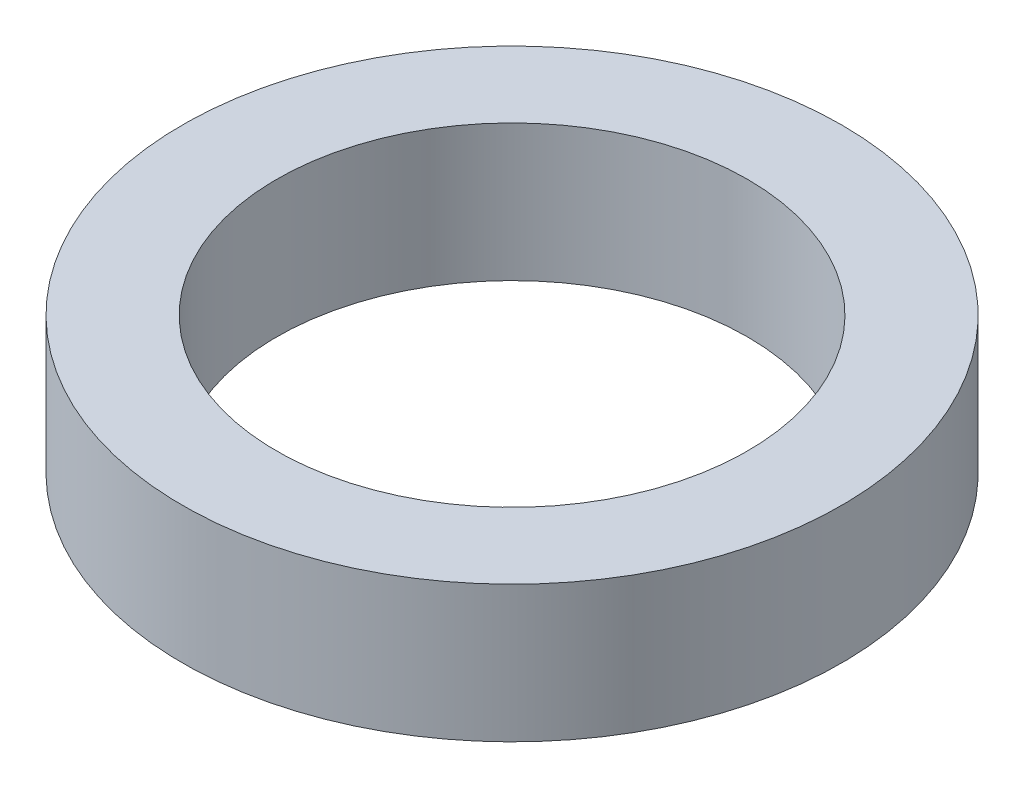
ISO-10303-21;
HEADER;
FILE_DESCRIPTION(('STEP AP214'),'2;1');
FILE_NAME('part.step','',(''),(''),'','','');
FILE_SCHEMA(('AUTOMOTIVE_DESIGN { 1 0 10303 214 1 1 1 1 }'));
ENDSEC;
DATA;
#1=APPLICATION_CONTEXT('core data for automotive mechanical design processes');
#2=APPLICATION_PROTOCOL_DEFINITION('international standard','automotive_design',2000,#1);
#3=PRODUCT_CONTEXT('',#1,'mechanical');
#4=PRODUCT('Part','Part','',(#3));
#5=PRODUCT_RELATED_PRODUCT_CATEGORY('part','',(#4));
#6=PRODUCT_DEFINITION_FORMATION('','',#4);
#7=PRODUCT_DEFINITION_CONTEXT('part definition',#1,'design');
#8=PRODUCT_DEFINITION('design','',#6,#7);
#9=PRODUCT_DEFINITION_SHAPE('','',#8);
#10=(LENGTH_UNIT() NAMED_UNIT(*) SI_UNIT(.MILLI.,.METRE.));
#11=(NAMED_UNIT(*) PLANE_ANGLE_UNIT() SI_UNIT($,.RADIAN.));
#12=(NAMED_UNIT(*) SI_UNIT($,.STERADIAN.) SOLID_ANGLE_UNIT());
#13=UNCERTAINTY_MEASURE_WITH_UNIT(LENGTH_MEASURE(1.E-05),#10,'distance_accuracy_value','');
#14=(GEOMETRIC_REPRESENTATION_CONTEXT(3) GLOBAL_UNCERTAINTY_ASSIGNED_CONTEXT((#13)) GLOBAL_UNIT_ASSIGNED_CONTEXT((#10,
#11,#12)) REPRESENTATION_CONTEXT('',''));
#15=CARTESIAN_POINT('',(0.,0.,0.));
#16=DIRECTION('',(0.,0.,1.));
#17=DIRECTION('',(1.,0.,0.));
#18=AXIS2_PLACEMENT_3D('',#15,#16,#17);
#19=CARTESIAN_POINT('',(0.,29.,0.));
#20=DIRECTION('',(0.,-1.,0.));
#21=DIRECTION('',(0.,0.,-1.));
#22=AXIS2_PLACEMENT_3D('',#19,#20,#21);
#23=CYLINDRICAL_SURFACE('',#22,70.);
#24=CARTESIAN_POINT('',(0.,29.,0.));
#25=DIRECTION('',(0.,1.,0.));
#26=DIRECTION('',(0.,0.,1.));
#27=AXIS2_PLACEMENT_3D('',#24,#25,#26);
#28=CIRCLE('',#27,70.);
#29=CARTESIAN_POINT('',(0.,29.,-70.));
#30=VERTEX_POINT('',#29);
#31=EDGE_CURVE('E10',#30,#30,#28,.T.);
#32=CARTESIAN_POINT('',(0.,0.,0.));
#33=DIRECTION('',(0.,1.,0.));
#34=DIRECTION('',(0.,0.,1.));
#35=AXIS2_PLACEMENT_3D('',#32,#33,#34);
#36=CIRCLE('',#35,70.);
#37=CARTESIAN_POINT('',(0.,0.,-70.));
#38=VERTEX_POINT('',#37);
#39=EDGE_CURVE('E37',#38,#38,#36,.T.);
#40=CARTESIAN_POINT('',(0.,29.,-70.));
#41=CARTESIAN_POINT('',(0.,28.6979166666667,-70.));
#42=CARTESIAN_POINT('',(0.,28.3958333333333,-70.));
#43=CARTESIAN_POINT('',(0.,27.7916666666667,-70.));
#44=CARTESIAN_POINT('',(0.,27.4895833333333,-70.));
#45=CARTESIAN_POINT('',(0.,26.8854166666667,-70.));
#46=CARTESIAN_POINT('',(0.,26.5833333333333,-70.));
#47=CARTESIAN_POINT('',(0.,25.9791666666667,-70.));
#48=CARTESIAN_POINT('',(0.,25.6770833333333,-70.));
#49=CARTESIAN_POINT('',(0.,25.0729166666667,-70.));
#50=CARTESIAN_POINT('',(0.,24.7708333333333,-70.));
#51=CARTESIAN_POINT('',(0.,24.1666666666667,-70.));
#52=CARTESIAN_POINT('',(0.,23.8645833333333,-70.));
#53=CARTESIAN_POINT('',(0.,23.2604166666667,-70.));
#54=CARTESIAN_POINT('',(0.,22.9583333333333,-70.));
#55=CARTESIAN_POINT('',(0.,22.3541666666667,-70.));
#56=CARTESIAN_POINT('',(0.,22.0520833333333,-70.));
#57=CARTESIAN_POINT('',(0.,21.4479166666667,-70.));
#58=CARTESIAN_POINT('',(0.,21.1458333333333,-70.));
#59=CARTESIAN_POINT('',(0.,20.5416666666667,-70.));
#60=CARTESIAN_POINT('',(0.,20.2395833333333,-70.));
#61=CARTESIAN_POINT('',(0.,19.6354166666667,-70.));
#62=CARTESIAN_POINT('',(0.,19.3333333333333,-70.));
#63=CARTESIAN_POINT('',(0.,18.7291666666667,-70.));
#64=CARTESIAN_POINT('',(0.,18.4270833333333,-70.));
#65=CARTESIAN_POINT('',(0.,17.8229166666667,-70.));
#66=CARTESIAN_POINT('',(0.,17.5208333333333,-70.));
#67=CARTESIAN_POINT('',(0.,16.9166666666667,-70.));
#68=CARTESIAN_POINT('',(0.,16.6145833333333,-70.));
#69=CARTESIAN_POINT('',(0.,16.0104166666667,-70.));
#70=CARTESIAN_POINT('',(0.,15.7083333333333,-70.));
#71=CARTESIAN_POINT('',(0.,15.1041666666667,-70.));
#72=CARTESIAN_POINT('',(0.,14.8020833333333,-70.));
#73=CARTESIAN_POINT('',(0.,14.1979166666667,-70.));
#74=CARTESIAN_POINT('',(0.,13.8958333333333,-70.));
#75=CARTESIAN_POINT('',(0.,13.2916666666667,-70.));
#76=CARTESIAN_POINT('',(0.,12.9895833333333,-70.));
#77=CARTESIAN_POINT('',(0.,12.3854166666667,-70.));
#78=CARTESIAN_POINT('',(0.,12.0833333333333,-70.));
#79=CARTESIAN_POINT('',(0.,11.4791666666667,-70.));
#80=CARTESIAN_POINT('',(0.,11.1770833333333,-70.));
#81=CARTESIAN_POINT('',(0.,10.5729166666667,-70.));
#82=CARTESIAN_POINT('',(0.,10.2708333333333,-70.));
#83=CARTESIAN_POINT('',(0.,9.66666666666667,-70.));
#84=CARTESIAN_POINT('',(0.,9.36458333333333,-70.));
#85=CARTESIAN_POINT('',(0.,8.76041666666667,-70.));
#86=CARTESIAN_POINT('',(0.,8.45833333333333,-70.));
#87=CARTESIAN_POINT('',(0.,7.85416666666667,-70.));
#88=CARTESIAN_POINT('',(0.,7.55208333333333,-70.));
#89=CARTESIAN_POINT('',(0.,6.94791666666667,-70.));
#90=CARTESIAN_POINT('',(0.,6.64583333333333,-70.));
#91=CARTESIAN_POINT('',(0.,6.04166666666667,-70.));
#92=CARTESIAN_POINT('',(0.,5.73958333333333,-70.));
#93=CARTESIAN_POINT('',(0.,5.13541666666667,-70.));
#94=CARTESIAN_POINT('',(0.,4.83333333333333,-70.));
#95=CARTESIAN_POINT('',(0.,4.22916666666667,-70.));
#96=CARTESIAN_POINT('',(0.,3.92708333333333,-70.));
#97=CARTESIAN_POINT('',(0.,3.32291666666667,-70.));
#98=CARTESIAN_POINT('',(0.,3.02083333333333,-70.));
#99=CARTESIAN_POINT('',(0.,2.41666666666667,-70.));
#100=CARTESIAN_POINT('',(0.,2.11458333333333,-70.));
#101=CARTESIAN_POINT('',(0.,1.51041666666667,-70.));
#102=CARTESIAN_POINT('',(0.,1.20833333333333,-70.));
#103=CARTESIAN_POINT('',(0.,0.604166666666667,-70.));
#104=CARTESIAN_POINT('',(0.,0.302083333333333,-70.));
#105=CARTESIAN_POINT('',(0.,0.,-70.));
#106=B_SPLINE_CURVE_WITH_KNOTS('',3,(#40,#41,#42,#43,#44,#45,#46,#47,#48,#49,#50,#51,#52,#53,
#54,#55,#56,#57,#58,#59,#60,#61,#62,#63,#64,#65,#66,#67,#68,#69,#70,#71,#72,#73,#74,#75,#76,#77,
#78,#79,#80,#81,#82,#83,#84,#85,#86,#87,#88,#89,#90,#91,#92,#93,#94,#95,#96,#97,#98,#99,#100,
#101,#102,#103,#104,#105),.UNSPECIFIED.,.F.,.F.,(4,2,2,2,2,2,2,2,2,2,2,2,2,2,2,2,2,2,2,2,2,2,2,
2,2,2,2,2,2,2,2,2,4),(0.,0.906250000000001,1.8125,2.71875,3.625,4.53125,5.4375,6.34375,7.25,
8.15625,9.0625,9.96875,10.875,11.78125,12.6875,13.59375,14.5,15.40625,16.3125,17.21875,18.125,
19.03125,19.9375,20.84375,21.75,22.65625,23.5625,24.46875,25.375,26.28125,27.1875,28.09375,29.),.UNSPECIFIED.);
#107=EDGE_CURVE('BSEAM40',#30,#38,#106,.T.);
#108=ORIENTED_EDGE('',*,*,#31,.F.);
#109=ORIENTED_EDGE('',*,*,#39,.T.);
#110=ORIENTED_EDGE('',*,*,#107,.T.);
#111=ORIENTED_EDGE('',*,*,#107,.F.);
#112=EDGE_LOOP('',(#108,#110,#109,#111));
#113=FACE_BOUND('',#112,.T.);
#114=ADVANCED_FACE('F40',(#113),#23,.T.);
#115=CARTESIAN_POINT('',(0.,29.,0.));
#116=DIRECTION('',(0.,1.,0.));
#117=DIRECTION('',(0.,0.,1.));
#118=AXIS2_PLACEMENT_3D('',#115,#116,#117);
#119=PLANE('',#118);
#120=CARTESIAN_POINT('',(0.,29.,0.));
#121=DIRECTION('',(0.,1.,0.));
#122=DIRECTION('',(0.,0.,1.));
#123=AXIS2_PLACEMENT_3D('',#120,#121,#122);
#124=CIRCLE('',#123,50.);
#125=CARTESIAN_POINT('',(0.,29.,-50.));
#126=VERTEX_POINT('',#125);
#127=EDGE_CURVE('E50',#126,#126,#124,.T.);
#128=ORIENTED_EDGE('',*,*,#127,.F.);
#129=EDGE_LOOP('',(#128));
#130=FACE_BOUND('',#129,.T.);
#131=ORIENTED_EDGE('',*,*,#31,.T.);
#132=EDGE_LOOP('',(#131));
#133=FACE_BOUND('',#132,.T.);
#134=ADVANCED_FACE('F59',(#130,#133),#119,.T.);
#135=CARTESIAN_POINT('',(0.,0.,0.));
#136=DIRECTION('',(0.,1.,0.));
#137=DIRECTION('',(0.,0.,1.));
#138=AXIS2_PLACEMENT_3D('',#135,#136,#137);
#139=PLANE('',#138);
#140=CARTESIAN_POINT('',(0.,0.,0.));
#141=DIRECTION('',(0.,1.,0.));
#142=DIRECTION('',(0.,0.,1.));
#143=AXIS2_PLACEMENT_3D('',#140,#141,#142);
#144=CIRCLE('',#143,50.);
#145=CARTESIAN_POINT('',(0.,0.,-50.));
#146=VERTEX_POINT('',#145);
#147=EDGE_CURVE('E47',#146,#146,#144,.T.);
#148=ORIENTED_EDGE('',*,*,#147,.T.);
#149=EDGE_LOOP('',(#148));
#150=FACE_BOUND('',#149,.T.);
#151=ORIENTED_EDGE('',*,*,#39,.F.);
#152=EDGE_LOOP('',(#151));
#153=FACE_BOUND('',#152,.T.);
#154=ADVANCED_FACE('F58',(#150,#153),#139,.F.);
#155=CARTESIAN_POINT('',(0.,29.,0.));
#156=DIRECTION('',(0.,-1.,0.));
#157=DIRECTION('',(0.,0.,-1.));
#158=AXIS2_PLACEMENT_3D('',#155,#156,#157);
#159=CYLINDRICAL_SURFACE('',#158,50.);
#160=CARTESIAN_POINT('',(0.,29.,-50.));
#161=CARTESIAN_POINT('',(0.,28.6979166666667,-50.));
#162=CARTESIAN_POINT('',(0.,28.3958333333333,-50.));
#163=CARTESIAN_POINT('',(0.,27.7916666666667,-50.));
#164=CARTESIAN_POINT('',(0.,27.4895833333333,-50.));
#165=CARTESIAN_POINT('',(0.,26.8854166666667,-50.));
#166=CARTESIAN_POINT('',(0.,26.5833333333333,-50.));
#167=CARTESIAN_POINT('',(0.,25.9791666666667,-50.));
#168=CARTESIAN_POINT('',(0.,25.6770833333333,-50.));
#169=CARTESIAN_POINT('',(0.,25.0729166666667,-50.));
#170=CARTESIAN_POINT('',(0.,24.7708333333333,-50.));
#171=CARTESIAN_POINT('',(0.,24.1666666666667,-50.));
#172=CARTESIAN_POINT('',(0.,23.8645833333333,-50.));
#173=CARTESIAN_POINT('',(0.,23.2604166666667,-50.));
#174=CARTESIAN_POINT('',(0.,22.9583333333333,-50.));
#175=CARTESIAN_POINT('',(0.,22.3541666666667,-50.));
#176=CARTESIAN_POINT('',(0.,22.0520833333333,-50.));
#177=CARTESIAN_POINT('',(0.,21.4479166666667,-50.));
#178=CARTESIAN_POINT('',(0.,21.1458333333333,-50.));
#179=CARTESIAN_POINT('',(0.,20.5416666666667,-50.));
#180=CARTESIAN_POINT('',(0.,20.2395833333333,-50.));
#181=CARTESIAN_POINT('',(0.,19.6354166666667,-50.));
#182=CARTESIAN_POINT('',(0.,19.3333333333333,-50.));
#183=CARTESIAN_POINT('',(0.,18.7291666666667,-50.));
#184=CARTESIAN_POINT('',(0.,18.4270833333333,-50.));
#185=CARTESIAN_POINT('',(0.,17.8229166666667,-50.));
#186=CARTESIAN_POINT('',(0.,17.5208333333333,-50.));
#187=CARTESIAN_POINT('',(0.,16.9166666666667,-50.));
#188=CARTESIAN_POINT('',(0.,16.6145833333333,-50.));
#189=CARTESIAN_POINT('',(0.,16.0104166666667,-50.));
#190=CARTESIAN_POINT('',(0.,15.7083333333333,-50.));
#191=CARTESIAN_POINT('',(0.,15.1041666666667,-50.));
#192=CARTESIAN_POINT('',(0.,14.8020833333333,-50.));
#193=CARTESIAN_POINT('',(0.,14.1979166666667,-50.));
#194=CARTESIAN_POINT('',(0.,13.8958333333333,-50.));
#195=CARTESIAN_POINT('',(0.,13.2916666666667,-50.));
#196=CARTESIAN_POINT('',(0.,12.9895833333333,-50.));
#197=CARTESIAN_POINT('',(0.,12.3854166666667,-50.));
#198=CARTESIAN_POINT('',(0.,12.0833333333333,-50.));
#199=CARTESIAN_POINT('',(0.,11.4791666666667,-50.));
#200=CARTESIAN_POINT('',(0.,11.1770833333333,-50.));
#201=CARTESIAN_POINT('',(0.,10.5729166666667,-50.));
#202=CARTESIAN_POINT('',(0.,10.2708333333333,-50.));
#203=CARTESIAN_POINT('',(0.,9.66666666666667,-50.));
#204=CARTESIAN_POINT('',(0.,9.36458333333333,-50.));
#205=CARTESIAN_POINT('',(0.,8.76041666666667,-50.));
#206=CARTESIAN_POINT('',(0.,8.45833333333333,-50.));
#207=CARTESIAN_POINT('',(0.,7.85416666666667,-50.));
#208=CARTESIAN_POINT('',(0.,7.55208333333333,-50.));
#209=CARTESIAN_POINT('',(0.,6.94791666666667,-50.));
#210=CARTESIAN_POINT('',(0.,6.64583333333333,-50.));
#211=CARTESIAN_POINT('',(0.,6.04166666666667,-50.));
#212=CARTESIAN_POINT('',(0.,5.73958333333333,-50.));
#213=CARTESIAN_POINT('',(0.,5.13541666666667,-50.));
#214=CARTESIAN_POINT('',(0.,4.83333333333333,-50.));
#215=CARTESIAN_POINT('',(0.,4.22916666666667,-50.));
#216=CARTESIAN_POINT('',(0.,3.92708333333333,-50.));
#217=CARTESIAN_POINT('',(0.,3.32291666666667,-50.));
#218=CARTESIAN_POINT('',(0.,3.02083333333333,-50.));
#219=CARTESIAN_POINT('',(0.,2.41666666666667,-50.));
#220=CARTESIAN_POINT('',(0.,2.11458333333333,-50.));
#221=CARTESIAN_POINT('',(0.,1.51041666666667,-50.));
#222=CARTESIAN_POINT('',(0.,1.20833333333333,-50.));
#223=CARTESIAN_POINT('',(0.,0.604166666666667,-50.));
#224=CARTESIAN_POINT('',(0.,0.302083333333333,-50.));
#225=CARTESIAN_POINT('',(0.,0.,-50.));
#226=B_SPLINE_CURVE_WITH_KNOTS('',3,(#160,#161,#162,#163,#164,#165,#166,#167,#168,#169,#170,
#171,#172,#173,#174,#175,#176,#177,#178,#179,#180,#181,#182,#183,#184,#185,#186,#187,#188,#189,
#190,#191,#192,#193,#194,#195,#196,#197,#198,#199,#200,#201,#202,#203,#204,#205,#206,#207,#208,
#209,#210,#211,#212,#213,#214,#215,#216,#217,#218,#219,#220,#221,#222,#223,#224,#225),
.UNSPECIFIED.,.F.,.F.,(4,2,2,2,2,2,2,2,2,2,2,2,2,2,2,2,2,2,2,2,2,2,2,2,2,2,2,2,2,2,2,2,4),(0.,
0.906250000000001,1.8125,2.71875,3.625,4.53125,5.4375,6.34375,7.25,8.15625,9.0625,9.96875,
10.875,11.78125,12.6875,13.59375,14.5,15.40625,16.3125,17.21875,18.125,19.03125,19.9375,
20.84375,21.75,22.65625,23.5625,24.46875,25.375,26.28125,27.1875,28.09375,29.),.UNSPECIFIED.);
#227=EDGE_CURVE('BSEAM54',#126,#146,#226,.T.);
#228=ORIENTED_EDGE('',*,*,#127,.T.);
#229=ORIENTED_EDGE('',*,*,#147,.F.);
#230=ORIENTED_EDGE('',*,*,#227,.T.);
#231=ORIENTED_EDGE('',*,*,#227,.F.);
#232=EDGE_LOOP('',(#228,#230,#229,#231));
#233=FACE_BOUND('',#232,.T.);
#234=ADVANCED_FACE('F54',(#233),#159,.F.);
#235=CLOSED_SHELL('',(#114,#134,#154,#234));
#236=MANIFOLD_SOLID_BREP('B2',#235);
#237=ADVANCED_BREP_SHAPE_REPRESENTATION('',(#18,#236),#14);
#238=SHAPE_DEFINITION_REPRESENTATION(#9,#237);
ENDSEC;
END-ISO-10303-21;
